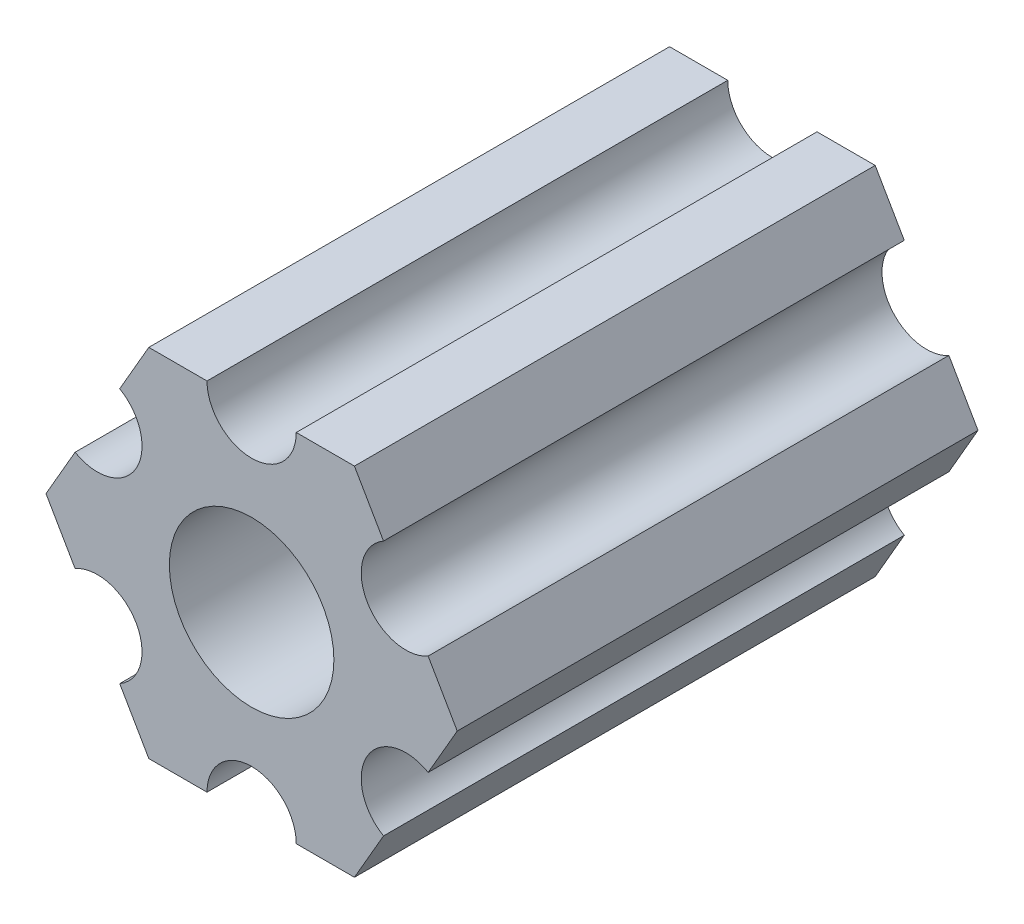
ISO-10303-21;
HEADER;
FILE_DESCRIPTION(('STEP AP214'),'2;1');
FILE_NAME('part.step','',(''),(''),'','','');
FILE_SCHEMA(('AUTOMOTIVE_DESIGN { 1 0 10303 214 1 1 1 1 }'));
ENDSEC;
DATA;
#1=APPLICATION_CONTEXT('core data for automotive mechanical design processes');
#2=APPLICATION_PROTOCOL_DEFINITION('international standard','automotive_design',2000,#1);
#3=PRODUCT_CONTEXT('',#1,'mechanical');
#4=PRODUCT('Part','Part','',(#3));
#5=PRODUCT_RELATED_PRODUCT_CATEGORY('part','',(#4));
#6=PRODUCT_DEFINITION_FORMATION('','',#4);
#7=PRODUCT_DEFINITION_CONTEXT('part definition',#1,'design');
#8=PRODUCT_DEFINITION('design','',#6,#7);
#9=PRODUCT_DEFINITION_SHAPE('','',#8);
#10=(LENGTH_UNIT() NAMED_UNIT(*) SI_UNIT(.MILLI.,.METRE.));
#11=(NAMED_UNIT(*) PLANE_ANGLE_UNIT() SI_UNIT($,.RADIAN.));
#12=(NAMED_UNIT(*) SI_UNIT($,.STERADIAN.) SOLID_ANGLE_UNIT());
#13=UNCERTAINTY_MEASURE_WITH_UNIT(LENGTH_MEASURE(1.E-05),#10,'distance_accuracy_value','');
#14=(GEOMETRIC_REPRESENTATION_CONTEXT(3) GLOBAL_UNCERTAINTY_ASSIGNED_CONTEXT((#13)) GLOBAL_UNIT_ASSIGNED_CONTEXT((#10,
#11,#12)) REPRESENTATION_CONTEXT('',''));
#15=CARTESIAN_POINT('',(0.,0.,0.));
#16=DIRECTION('',(0.,0.,1.));
#17=DIRECTION('',(1.,0.,0.));
#18=AXIS2_PLACEMENT_3D('',#15,#16,#17);
#19=CARTESIAN_POINT('',(5.4992613140312,-3.17499999999998,18.56994));
#20=DIRECTION('',(0.,0.,-1.));
#21=DIRECTION('',(-1.,0.,0.));
#22=AXIS2_PLACEMENT_3D('',#19,#20,#21);
#23=CYLINDRICAL_SURFACE('',#22,1.59130995915342);
#24=CARTESIAN_POINT('',(5.4992613140312,-3.17499999999998,0.));
#25=DIRECTION('',(0.,0.,1.));
#26=DIRECTION('',(1.,0.,0.));
#27=AXIS2_PLACEMENT_3D('',#24,#25,#26);
#28=CIRCLE('',#27,1.59130995915342);
#29=CARTESIAN_POINT('',(6.29491629360791,-1.79688515007798,0.));
#30=VERTEX_POINT('',#29);
#31=CARTESIAN_POINT('',(4.70360633445448,-4.55311484992188,0.));
#32=VERTEX_POINT('',#31);
#33=EDGE_CURVE('E186',#30,#32,#28,.T.);
#34=ORIENTED_EDGE('',*,*,#33,.F.);
#35=DIRECTION('',(0.,0.,-1.));
#36=VECTOR('',#35,1.);
#37=CARTESIAN_POINT('',(6.29491629360791,-1.79688515007798,18.56994));
#38=LINE('',#37,#36);
#39=CARTESIAN_POINT('',(6.29491629360791,-1.79688515007798,18.56994));
#40=VERTEX_POINT('',#39);
#41=EDGE_CURVE('E11',#40,#30,#38,.T.);
#42=ORIENTED_EDGE('',*,*,#41,.F.);
#43=CARTESIAN_POINT('',(5.4992613140312,-3.17499999999998,18.56994));
#44=DIRECTION('',(0.,0.,1.));
#45=DIRECTION('',(1.,0.,0.));
#46=AXIS2_PLACEMENT_3D('',#43,#44,#45);
#47=CIRCLE('',#46,1.59130995915342);
#48=CARTESIAN_POINT('',(4.70360633445448,-4.55311484992188,18.56994));
#49=VERTEX_POINT('',#48);
#50=EDGE_CURVE('E237',#40,#49,#47,.T.);
#51=ORIENTED_EDGE('',*,*,#50,.T.);
#52=DIRECTION('',(0.,0.,-1.));
#53=VECTOR('',#52,1.);
#54=CARTESIAN_POINT('',(4.70360633445448,-4.55311484992188,18.56994));
#55=LINE('',#54,#53);
#56=EDGE_CURVE('E32',#49,#32,#55,.T.);
#57=ORIENTED_EDGE('',*,*,#56,.T.);
#58=EDGE_LOOP('',(#34,#42,#51,#57));
#59=FACE_BOUND('',#58,.T.);
#60=ADVANCED_FACE('F29',(#59),#23,.F.);
#61=CARTESIAN_POINT('',(7.33234841870824,0.,18.56994));
#62=DIRECTION('',(0.86602540378444,-0.499999999999999,0.));
#63=DIRECTION('',(0.499999999999999,0.86602540378444,0.));
#64=AXIS2_PLACEMENT_3D('',#61,#62,#63);
#65=PLANE('',#64);
#66=DIRECTION('',(-0.499999999999999,-0.866025403784439,0.));
#67=VECTOR('',#66,1.);
#68=CARTESIAN_POINT('',(7.33234841870824,0.,0.));
#69=LINE('',#68,#67);
#70=CARTESIAN_POINT('',(7.33234841870824,0.,0.));
#71=VERTEX_POINT('',#70);
#72=EDGE_CURVE('E235',#71,#30,#69,.T.);
#73=ORIENTED_EDGE('',*,*,#72,.F.);
#74=DIRECTION('',(0.,0.,-1.));
#75=VECTOR('',#74,1.);
#76=CARTESIAN_POINT('',(7.33234841870824,0.,18.56994));
#77=LINE('',#76,#75);
#78=CARTESIAN_POINT('',(7.33234841870824,0.,18.56994));
#79=VERTEX_POINT('',#78);
#80=EDGE_CURVE('E38',#79,#71,#77,.T.);
#81=ORIENTED_EDGE('',*,*,#80,.F.);
#82=DIRECTION('',(-0.499999999999999,-0.866025403784439,0.));
#83=VECTOR('',#82,1.);
#84=CARTESIAN_POINT('',(7.33234841870824,0.,18.56994));
#85=LINE('',#84,#83);
#86=EDGE_CURVE('E176',#79,#40,#85,.T.);
#87=ORIENTED_EDGE('',*,*,#86,.T.);
#88=ORIENTED_EDGE('',*,*,#41,.T.);
#89=EDGE_LOOP('',(#73,#81,#87,#88));
#90=FACE_BOUND('',#89,.T.);
#91=ADVANCED_FACE('F269',(#90),#65,.T.);
#92=CARTESIAN_POINT('',(6.29491629360791,1.79688515007798,18.56994));
#93=DIRECTION('',(0.86602540378444,0.499999999999999,0.));
#94=DIRECTION('',(-0.499999999999999,0.86602540378444,0.));
#95=AXIS2_PLACEMENT_3D('',#92,#93,#94);
#96=PLANE('',#95);
#97=DIRECTION('',(0.499999999999999,-0.86602540378444,0.));
#98=VECTOR('',#97,1.);
#99=CARTESIAN_POINT('',(6.29491629360791,1.79688515007798,0.));
#100=LINE('',#99,#98);
#101=CARTESIAN_POINT('',(6.29491629360791,1.79688515007798,0.));
#102=VERTEX_POINT('',#101);
#103=EDGE_CURVE('E163',#102,#71,#100,.T.);
#104=ORIENTED_EDGE('',*,*,#103,.F.);
#105=DIRECTION('',(0.,0.,-1.));
#106=VECTOR('',#105,1.);
#107=CARTESIAN_POINT('',(6.29491629360791,1.79688515007798,18.56994));
#108=LINE('',#107,#106);
#109=CARTESIAN_POINT('',(6.29491629360791,1.79688515007798,18.56994));
#110=VERTEX_POINT('',#109);
#111=EDGE_CURVE('E158',#110,#102,#108,.T.);
#112=ORIENTED_EDGE('',*,*,#111,.F.);
#113=DIRECTION('',(0.499999999999999,-0.86602540378444,0.));
#114=VECTOR('',#113,1.);
#115=CARTESIAN_POINT('',(6.29491629360791,1.79688515007798,18.56994));
#116=LINE('',#115,#114);
#117=EDGE_CURVE('E161',#110,#79,#116,.T.);
#118=ORIENTED_EDGE('',*,*,#117,.T.);
#119=ORIENTED_EDGE('',*,*,#80,.T.);
#120=EDGE_LOOP('',(#104,#112,#118,#119));
#121=FACE_BOUND('',#120,.T.);
#122=ADVANCED_FACE('F160',(#121),#96,.T.);
#123=CARTESIAN_POINT('',(5.49926131403115,3.17500000000015,18.56994));
#124=DIRECTION('',(0.,0.,-1.));
#125=DIRECTION('',(-1.,0.,0.));
#126=AXIS2_PLACEMENT_3D('',#123,#124,#125);
#127=CYLINDRICAL_SURFACE('',#126,1.59130995915342);
#128=CARTESIAN_POINT('',(5.49926131403115,3.17500000000015,0.));
#129=DIRECTION('',(0.,0.,1.));
#130=DIRECTION('',(1.,0.,0.));
#131=AXIS2_PLACEMENT_3D('',#128,#129,#130);
#132=CIRCLE('',#131,1.59130995915342);
#133=CARTESIAN_POINT('',(4.70360633445447,4.55311484992205,0.));
#134=VERTEX_POINT('',#133);
#135=EDGE_CURVE('E232',#134,#102,#132,.T.);
#136=ORIENTED_EDGE('',*,*,#135,.F.);
#137=DIRECTION('',(0.,0.,-1.));
#138=VECTOR('',#137,1.);
#139=CARTESIAN_POINT('',(4.70360633445447,4.55311484992205,18.56994));
#140=LINE('',#139,#138);
#141=CARTESIAN_POINT('',(4.70360633445447,4.55311484992205,18.56994));
#142=VERTEX_POINT('',#141);
#143=EDGE_CURVE('E168',#142,#134,#140,.T.);
#144=ORIENTED_EDGE('',*,*,#143,.F.);
#145=CARTESIAN_POINT('',(5.49926131403115,3.17500000000015,18.56994));
#146=DIRECTION('',(0.,0.,1.));
#147=DIRECTION('',(1.,0.,0.));
#148=AXIS2_PLACEMENT_3D('',#145,#146,#147);
#149=CIRCLE('',#148,1.59130995915342);
#150=EDGE_CURVE('E174',#142,#110,#149,.T.);
#151=ORIENTED_EDGE('',*,*,#150,.T.);
#152=ORIENTED_EDGE('',*,*,#111,.T.);
#153=EDGE_LOOP('',(#136,#144,#151,#152));
#154=FACE_BOUND('',#153,.T.);
#155=ADVANCED_FACE('F178',(#154),#127,.F.);
#156=CARTESIAN_POINT('',(3.66617420935422,6.35000000000005,18.56994));
#157=DIRECTION('',(0.866025403784439,0.500000000000001,0.));
#158=DIRECTION('',(-0.500000000000001,0.866025403784439,0.));
#159=AXIS2_PLACEMENT_3D('',#156,#157,#158);
#160=PLANE('',#159);
#161=DIRECTION('',(0.5,-0.866025403784438,0.));
#162=VECTOR('',#161,1.);
#163=CARTESIAN_POINT('',(3.66617420935422,6.35000000000005,0.));
#164=LINE('',#163,#162);
#165=CARTESIAN_POINT('',(3.66617420935422,6.35000000000005,0.));
#166=VERTEX_POINT('',#165);
#167=EDGE_CURVE('E229',#166,#134,#164,.T.);
#168=ORIENTED_EDGE('',*,*,#167,.F.);
#169=DIRECTION('',(0.,0.,-1.));
#170=VECTOR('',#169,1.);
#171=CARTESIAN_POINT('',(3.66617420935422,6.35000000000005,18.56994));
#172=LINE('',#171,#170);
#173=CARTESIAN_POINT('',(3.66617420935422,6.35000000000005,18.56994));
#174=VERTEX_POINT('',#173);
#175=EDGE_CURVE('E241',#174,#166,#172,.T.);
#176=ORIENTED_EDGE('',*,*,#175,.F.);
#177=DIRECTION('',(0.5,-0.866025403784438,0.));
#178=VECTOR('',#177,1.);
#179=CARTESIAN_POINT('',(3.66617420935422,6.35000000000005,18.56994));
#180=LINE('',#179,#178);
#181=EDGE_CURVE('E179',#174,#142,#180,.T.);
#182=ORIENTED_EDGE('',*,*,#181,.T.);
#183=ORIENTED_EDGE('',*,*,#143,.T.);
#184=EDGE_LOOP('',(#168,#176,#182,#183));
#185=FACE_BOUND('',#184,.T.);
#186=ADVANCED_FACE('F282',(#185),#160,.T.);
#187=CARTESIAN_POINT('',(1.59130995915353,6.35000000000005,18.56994));
#188=DIRECTION('',(0.,1.,0.));
#189=DIRECTION('',(0.,0.,1.));
#190=AXIS2_PLACEMENT_3D('',#187,#188,#189);
#191=PLANE('',#190);
#192=DIRECTION('',(1.,0.,0.));
#193=VECTOR('',#192,1.);
#194=CARTESIAN_POINT('',(1.59130995915353,6.35000000000005,0.));
#195=LINE('',#194,#193);
#196=CARTESIAN_POINT('',(1.59130995915353,6.35000000000005,0.));
#197=VERTEX_POINT('',#196);
#198=EDGE_CURVE('E226',#197,#166,#195,.T.);
#199=ORIENTED_EDGE('',*,*,#198,.F.);
#200=DIRECTION('',(0.,0.,-1.));
#201=VECTOR('',#200,1.);
#202=CARTESIAN_POINT('',(1.59130995915353,6.35000000000005,18.56994));
#203=LINE('',#202,#201);
#204=CARTESIAN_POINT('',(1.59130995915353,6.35000000000005,18.56994));
#205=VERTEX_POINT('',#204);
#206=EDGE_CURVE('E243',#205,#197,#203,.T.);
#207=ORIENTED_EDGE('',*,*,#206,.F.);
#208=DIRECTION('',(1.,0.,0.));
#209=VECTOR('',#208,1.);
#210=CARTESIAN_POINT('',(1.59130995915353,6.35000000000005,18.56994));
#211=LINE('',#210,#209);
#212=EDGE_CURVE('E181',#205,#174,#211,.T.);
#213=ORIENTED_EDGE('',*,*,#212,.T.);
#214=ORIENTED_EDGE('',*,*,#175,.T.);
#215=EDGE_LOOP('',(#199,#207,#213,#214));
#216=FACE_BOUND('',#215,.T.);
#217=ADVANCED_FACE('F285',(#216),#191,.T.);
#218=CARTESIAN_POINT('',(0.,6.35000000000011,18.56994));
#219=DIRECTION('',(0.,0.,-1.));
#220=DIRECTION('',(-1.,0.,0.));
#221=AXIS2_PLACEMENT_3D('',#218,#219,#220);
#222=CYLINDRICAL_SURFACE('',#221,1.59130995915342);
#223=CARTESIAN_POINT('',(0.,6.35000000000011,0.));
#224=DIRECTION('',(0.,0.,1.));
#225=DIRECTION('',(1.,0.,0.));
#226=AXIS2_PLACEMENT_3D('',#223,#224,#225);
#227=CIRCLE('',#226,1.59130995915342);
#228=CARTESIAN_POINT('',(-1.59130995915337,6.35000000000002,0.));
#229=VERTEX_POINT('',#228);
#230=EDGE_CURVE('E223',#229,#197,#227,.T.);
#231=ORIENTED_EDGE('',*,*,#230,.F.);
#232=DIRECTION('',(0.,0.,-1.));
#233=VECTOR('',#232,1.);
#234=CARTESIAN_POINT('',(-1.59130995915337,6.35000000000002,18.56994));
#235=LINE('',#234,#233);
#236=CARTESIAN_POINT('',(-1.59130995915337,6.35000000000002,18.56994));
#237=VERTEX_POINT('',#236);
#238=EDGE_CURVE('E245',#237,#229,#235,.T.);
#239=ORIENTED_EDGE('',*,*,#238,.F.);
#240=CARTESIAN_POINT('',(0.,6.35000000000011,18.56994));
#241=DIRECTION('',(0.,0.,1.));
#242=DIRECTION('',(1.,0.,0.));
#243=AXIS2_PLACEMENT_3D('',#240,#241,#242);
#244=CIRCLE('',#243,1.59130995915342);
#245=EDGE_CURVE('E390',#237,#205,#244,.T.);
#246=ORIENTED_EDGE('',*,*,#245,.T.);
#247=ORIENTED_EDGE('',*,*,#206,.T.);
#248=EDGE_LOOP('',(#231,#239,#246,#247));
#249=FACE_BOUND('',#248,.T.);
#250=ADVANCED_FACE('F289',(#249),#222,.F.);
#251=CARTESIAN_POINT('',(-3.66617420935408,6.35000000000011,18.56994));
#252=DIRECTION('',(0.,1.,0.));
#253=DIRECTION('',(0.,0.,1.));
#254=AXIS2_PLACEMENT_3D('',#251,#252,#253);
#255=PLANE('',#254);
#256=DIRECTION('',(1.,0.,0.));
#257=VECTOR('',#256,1.);
#258=CARTESIAN_POINT('',(-3.66617420935408,6.35000000000011,0.));
#259=LINE('',#258,#257);
#260=CARTESIAN_POINT('',(-3.66617420935408,6.35000000000011,0.));
#261=VERTEX_POINT('',#260);
#262=EDGE_CURVE('E220',#261,#229,#259,.T.);
#263=ORIENTED_EDGE('',*,*,#262,.F.);
#264=DIRECTION('',(0.,0.,-1.));
#265=VECTOR('',#264,1.);
#266=CARTESIAN_POINT('',(-3.66617420935408,6.35000000000011,18.56994));
#267=LINE('',#266,#265);
#268=CARTESIAN_POINT('',(-3.66617420935408,6.35000000000011,18.56994));
#269=VERTEX_POINT('',#268);
#270=EDGE_CURVE('E247',#269,#261,#267,.T.);
#271=ORIENTED_EDGE('',*,*,#270,.F.);
#272=DIRECTION('',(1.,0.,0.));
#273=VECTOR('',#272,1.);
#274=CARTESIAN_POINT('',(-3.66617420935408,6.35000000000011,18.56994));
#275=LINE('',#274,#273);
#276=EDGE_CURVE('E387',#269,#237,#275,.T.);
#277=ORIENTED_EDGE('',*,*,#276,.T.);
#278=ORIENTED_EDGE('',*,*,#238,.T.);
#279=EDGE_LOOP('',(#263,#271,#277,#278));
#280=FACE_BOUND('',#279,.T.);
#281=ADVANCED_FACE('F293',(#280),#255,.T.);
#282=CARTESIAN_POINT('',(-4.70360633445442,4.55311484992213,18.56994));
#283=DIRECTION('',(-0.866025403784439,0.5,0.));
#284=DIRECTION('',(-0.5,-0.866025403784439,0.));
#285=AXIS2_PLACEMENT_3D('',#282,#283,#284);
#286=PLANE('',#285);
#287=DIRECTION('',(0.5,0.866025403784439,0.));
#288=VECTOR('',#287,1.);
#289=CARTESIAN_POINT('',(-4.70360633445442,4.55311484992213,0.));
#290=LINE('',#289,#288);
#291=CARTESIAN_POINT('',(-4.70360633445442,4.55311484992213,0.));
#292=VERTEX_POINT('',#291);
#293=EDGE_CURVE('E217',#292,#261,#290,.T.);
#294=ORIENTED_EDGE('',*,*,#293,.F.);
#295=DIRECTION('',(0.,0.,-1.));
#296=VECTOR('',#295,1.);
#297=CARTESIAN_POINT('',(-4.70360633445442,4.55311484992213,18.56994));
#298=LINE('',#297,#296);
#299=CARTESIAN_POINT('',(-4.70360633445442,4.55311484992213,18.56994));
#300=VERTEX_POINT('',#299);
#301=EDGE_CURVE('E249',#300,#292,#298,.T.);
#302=ORIENTED_EDGE('',*,*,#301,.F.);
#303=DIRECTION('',(0.5,0.866025403784439,0.));
#304=VECTOR('',#303,1.);
#305=CARTESIAN_POINT('',(-4.70360633445442,4.55311484992213,18.56994));
#306=LINE('',#305,#304);
#307=EDGE_CURVE('E384',#300,#269,#306,.T.);
#308=ORIENTED_EDGE('',*,*,#307,.T.);
#309=ORIENTED_EDGE('',*,*,#270,.T.);
#310=EDGE_LOOP('',(#294,#302,#308,#309));
#311=FACE_BOUND('',#310,.T.);
#312=ADVANCED_FACE('F297',(#311),#286,.T.);
#313=CARTESIAN_POINT('',(-5.49926131403112,3.17500000000009,18.56994));
#314=DIRECTION('',(0.,0.,-1.));
#315=DIRECTION('',(-1.,0.,0.));
#316=AXIS2_PLACEMENT_3D('',#313,#314,#315);
#317=CYLINDRICAL_SURFACE('',#316,1.59130995915342);
#318=CARTESIAN_POINT('',(-5.49926131403112,3.17500000000009,0.));
#319=DIRECTION('',(0.,0.,1.));
#320=DIRECTION('',(1.,0.,0.));
#321=AXIS2_PLACEMENT_3D('',#318,#319,#320);
#322=CIRCLE('',#321,1.59130995915342);
#323=CARTESIAN_POINT('',(-6.29491629360782,1.79688515007809,0.));
#324=VERTEX_POINT('',#323);
#325=EDGE_CURVE('E214',#324,#292,#322,.T.);
#326=ORIENTED_EDGE('',*,*,#325,.F.);
#327=DIRECTION('',(0.,0.,-1.));
#328=VECTOR('',#327,1.);
#329=CARTESIAN_POINT('',(-6.29491629360782,1.79688515007809,18.56994));
#330=LINE('',#329,#328);
#331=CARTESIAN_POINT('',(-6.29491629360782,1.79688515007809,18.56994));
#332=VERTEX_POINT('',#331);
#333=EDGE_CURVE('E251',#332,#324,#330,.T.);
#334=ORIENTED_EDGE('',*,*,#333,.F.);
#335=CARTESIAN_POINT('',(-5.49926131403112,3.17500000000009,18.56994));
#336=DIRECTION('',(0.,0.,1.));
#337=DIRECTION('',(1.,0.,0.));
#338=AXIS2_PLACEMENT_3D('',#335,#336,#337);
#339=CIRCLE('',#338,1.59130995915342);
#340=EDGE_CURVE('E381',#332,#300,#339,.T.);
#341=ORIENTED_EDGE('',*,*,#340,.T.);
#342=ORIENTED_EDGE('',*,*,#301,.T.);
#343=EDGE_LOOP('',(#326,#334,#341,#342));
#344=FACE_BOUND('',#343,.T.);
#345=ADVANCED_FACE('F301',(#344),#317,.F.);
#346=CARTESIAN_POINT('',(-7.33234841870815,0.,18.56994));
#347=DIRECTION('',(-0.866025403784438,0.5,0.));
#348=DIRECTION('',(-0.5,-0.866025403784438,0.));
#349=AXIS2_PLACEMENT_3D('',#346,#347,#348);
#350=PLANE('',#349);
#351=DIRECTION('',(0.5,0.866025403784438,0.));
#352=VECTOR('',#351,1.);
#353=CARTESIAN_POINT('',(-7.33234841870815,0.,0.));
#354=LINE('',#353,#352);
#355=CARTESIAN_POINT('',(-7.33234841870815,0.,0.));
#356=VERTEX_POINT('',#355);
#357=EDGE_CURVE('E211',#356,#324,#354,.T.);
#358=ORIENTED_EDGE('',*,*,#357,.F.);
#359=DIRECTION('',(0.,0.,-1.));
#360=VECTOR('',#359,1.);
#361=CARTESIAN_POINT('',(-7.33234841870815,0.,18.56994));
#362=LINE('',#361,#360);
#363=CARTESIAN_POINT('',(-7.33234841870815,0.,18.56994));
#364=VERTEX_POINT('',#363);
#365=EDGE_CURVE('E253',#364,#356,#362,.T.);
#366=ORIENTED_EDGE('',*,*,#365,.F.);
#367=DIRECTION('',(0.5,0.866025403784438,0.));
#368=VECTOR('',#367,1.);
#369=CARTESIAN_POINT('',(-7.33234841870815,0.,18.56994));
#370=LINE('',#369,#368);
#371=EDGE_CURVE('E378',#364,#332,#370,.T.);
#372=ORIENTED_EDGE('',*,*,#371,.T.);
#373=ORIENTED_EDGE('',*,*,#333,.T.);
#374=EDGE_LOOP('',(#358,#366,#372,#373));
#375=FACE_BOUND('',#374,.T.);
#376=ADVANCED_FACE('F305',(#375),#350,.T.);
#377=CARTESIAN_POINT('',(-6.29491629360792,-1.79688515007792,18.56994));
#378=DIRECTION('',(-0.866025403784439,-0.5,0.));
#379=DIRECTION('',(0.5,-0.866025403784439,0.));
#380=AXIS2_PLACEMENT_3D('',#377,#378,#379);
#381=PLANE('',#380);
#382=DIRECTION('',(-0.5,0.866025403784439,0.));
#383=VECTOR('',#382,1.);
#384=CARTESIAN_POINT('',(-6.29491629360792,-1.79688515007792,0.));
#385=LINE('',#384,#383);
#386=CARTESIAN_POINT('',(-6.29491629360792,-1.79688515007792,0.));
#387=VERTEX_POINT('',#386);
#388=EDGE_CURVE('E208',#387,#356,#385,.T.);
#389=ORIENTED_EDGE('',*,*,#388,.F.);
#390=DIRECTION('',(0.,0.,-1.));
#391=VECTOR('',#390,1.);
#392=CARTESIAN_POINT('',(-6.29491629360792,-1.79688515007792,18.56994));
#393=LINE('',#392,#391);
#394=CARTESIAN_POINT('',(-6.29491629360792,-1.79688515007792,18.56994));
#395=VERTEX_POINT('',#394);
#396=EDGE_CURVE('E255',#395,#387,#393,.T.);
#397=ORIENTED_EDGE('',*,*,#396,.F.);
#398=DIRECTION('',(-0.5,0.866025403784439,0.));
#399=VECTOR('',#398,1.);
#400=CARTESIAN_POINT('',(-6.29491629360792,-1.79688515007792,18.56994));
#401=LINE('',#400,#399);
#402=EDGE_CURVE('E375',#395,#364,#401,.T.);
#403=ORIENTED_EDGE('',*,*,#402,.T.);
#404=ORIENTED_EDGE('',*,*,#365,.T.);
#405=EDGE_LOOP('',(#389,#397,#403,#404));
#406=FACE_BOUND('',#405,.T.);
#407=ADVANCED_FACE('F309',(#406),#381,.T.);
#408=CARTESIAN_POINT('',(-5.49926131403123,-3.17499999999993,18.56994));
#409=DIRECTION('',(0.,0.,-1.));
#410=DIRECTION('',(-1.,0.,0.));
#411=AXIS2_PLACEMENT_3D('',#408,#409,#410);
#412=CYLINDRICAL_SURFACE('',#411,1.59130995915342);
#413=CARTESIAN_POINT('',(-5.49926131403123,-3.17499999999993,0.));
#414=DIRECTION('',(0.,0.,1.));
#415=DIRECTION('',(1.,0.,0.));
#416=AXIS2_PLACEMENT_3D('',#413,#414,#415);
#417=CIRCLE('',#416,1.59130995915342);
#418=CARTESIAN_POINT('',(-4.70360633445447,-4.55311484992205,0.));
#419=VERTEX_POINT('',#418);
#420=EDGE_CURVE('E205',#419,#387,#417,.T.);
#421=ORIENTED_EDGE('',*,*,#420,.F.);
#422=DIRECTION('',(0.,0.,-1.));
#423=VECTOR('',#422,1.);
#424=CARTESIAN_POINT('',(-4.70360633445447,-4.55311484992205,18.56994));
#425=LINE('',#424,#423);
#426=CARTESIAN_POINT('',(-4.70360633445447,-4.55311484992205,18.56994));
#427=VERTEX_POINT('',#426);
#428=EDGE_CURVE('E257',#427,#419,#425,.T.);
#429=ORIENTED_EDGE('',*,*,#428,.F.);
#430=CARTESIAN_POINT('',(-5.49926131403123,-3.17499999999993,18.56994));
#431=DIRECTION('',(0.,0.,1.));
#432=DIRECTION('',(1.,0.,0.));
#433=AXIS2_PLACEMENT_3D('',#430,#431,#432);
#434=CIRCLE('',#433,1.59130995915342);
#435=EDGE_CURVE('E372',#427,#395,#434,.T.);
#436=ORIENTED_EDGE('',*,*,#435,.T.);
#437=ORIENTED_EDGE('',*,*,#396,.T.);
#438=EDGE_LOOP('',(#421,#429,#436,#437));
#439=FACE_BOUND('',#438,.T.);
#440=ADVANCED_FACE('F313',(#439),#412,.F.);
#441=CARTESIAN_POINT('',(-3.6661742093541,-6.34999999999997,18.56994));
#442=DIRECTION('',(-0.866025403784439,-0.5,0.));
#443=DIRECTION('',(0.5,-0.866025403784439,0.));
#444=AXIS2_PLACEMENT_3D('',#441,#442,#443);
#445=PLANE('',#444);
#446=DIRECTION('',(-0.5,0.866025403784439,0.));
#447=VECTOR('',#446,1.);
#448=CARTESIAN_POINT('',(-3.6661742093541,-6.34999999999997,0.));
#449=LINE('',#448,#447);
#450=CARTESIAN_POINT('',(-3.6661742093541,-6.34999999999997,0.));
#451=VERTEX_POINT('',#450);
#452=EDGE_CURVE('E202',#451,#419,#449,.T.);
#453=ORIENTED_EDGE('',*,*,#452,.F.);
#454=DIRECTION('',(0.,0.,-1.));
#455=VECTOR('',#454,1.);
#456=CARTESIAN_POINT('',(-3.6661742093541,-6.34999999999997,18.56994));
#457=LINE('',#456,#455);
#458=CARTESIAN_POINT('',(-3.6661742093541,-6.34999999999997,18.56994));
#459=VERTEX_POINT('',#458);
#460=EDGE_CURVE('E259',#459,#451,#457,.T.);
#461=ORIENTED_EDGE('',*,*,#460,.F.);
#462=DIRECTION('',(-0.5,0.866025403784439,0.));
#463=VECTOR('',#462,1.);
#464=CARTESIAN_POINT('',(-3.6661742093541,-6.34999999999997,18.56994));
#465=LINE('',#464,#463);
#466=EDGE_CURVE('E369',#459,#427,#465,.T.);
#467=ORIENTED_EDGE('',*,*,#466,.T.);
#468=ORIENTED_EDGE('',*,*,#428,.T.);
#469=EDGE_LOOP('',(#453,#461,#467,#468));
#470=FACE_BOUND('',#469,.T.);
#471=ADVANCED_FACE('F317',(#470),#445,.T.);
#472=CARTESIAN_POINT('',(-1.59130995915342,-6.35000000000002,18.56994));
#473=DIRECTION('',(0.,-1.,0.));
#474=DIRECTION('',(0.,0.,-1.));
#475=AXIS2_PLACEMENT_3D('',#472,#473,#474);
#476=PLANE('',#475);
#477=DIRECTION('',(-1.,0.,0.));
#478=VECTOR('',#477,1.);
#479=CARTESIAN_POINT('',(-1.59130995915342,-6.35000000000002,0.));
#480=LINE('',#479,#478);
#481=CARTESIAN_POINT('',(-1.59130995915342,-6.35000000000002,0.));
#482=VERTEX_POINT('',#481);
#483=EDGE_CURVE('E199',#482,#451,#480,.T.);
#484=ORIENTED_EDGE('',*,*,#483,.F.);
#485=DIRECTION('',(0.,0.,-1.));
#486=VECTOR('',#485,1.);
#487=CARTESIAN_POINT('',(-1.59130995915342,-6.35000000000002,18.56994));
#488=LINE('',#487,#486);
#489=CARTESIAN_POINT('',(-1.59130995915342,-6.35000000000002,18.56994));
#490=VERTEX_POINT('',#489);
#491=EDGE_CURVE('E261',#490,#482,#488,.T.);
#492=ORIENTED_EDGE('',*,*,#491,.F.);
#493=DIRECTION('',(-1.,0.,0.));
#494=VECTOR('',#493,1.);
#495=CARTESIAN_POINT('',(-1.59130995915342,-6.35000000000002,18.56994));
#496=LINE('',#495,#494);
#497=EDGE_CURVE('E366',#490,#459,#496,.T.);
#498=ORIENTED_EDGE('',*,*,#497,.T.);
#499=ORIENTED_EDGE('',*,*,#460,.T.);
#500=EDGE_LOOP('',(#484,#492,#498,#499));
#501=FACE_BOUND('',#500,.T.);
#502=ADVANCED_FACE('F321',(#501),#476,.T.);
#503=CARTESIAN_POINT('',(0.,-6.34999999999997,18.56994));
#504=DIRECTION('',(0.,0.,-1.));
#505=DIRECTION('',(-1.,0.,0.));
#506=AXIS2_PLACEMENT_3D('',#503,#504,#505);
#507=CYLINDRICAL_SURFACE('',#506,1.59130995915342);
#508=CARTESIAN_POINT('',(0.,-6.34999999999997,0.));
#509=DIRECTION('',(0.,0.,1.));
#510=DIRECTION('',(1.,0.,0.));
#511=AXIS2_PLACEMENT_3D('',#508,#509,#510);
#512=CIRCLE('',#511,1.59130995915342);
#513=CARTESIAN_POINT('',(1.59130995915344,-6.34999999999997,0.));
#514=VERTEX_POINT('',#513);
#515=EDGE_CURVE('E196',#514,#482,#512,.T.);
#516=ORIENTED_EDGE('',*,*,#515,.F.);
#517=DIRECTION('',(0.,0.,-1.));
#518=VECTOR('',#517,1.);
#519=CARTESIAN_POINT('',(1.59130995915344,-6.34999999999997,18.56994));
#520=LINE('',#519,#518);
#521=CARTESIAN_POINT('',(1.59130995915344,-6.34999999999997,18.56994));
#522=VERTEX_POINT('',#521);
#523=EDGE_CURVE('E263',#522,#514,#520,.T.);
#524=ORIENTED_EDGE('',*,*,#523,.F.);
#525=CARTESIAN_POINT('',(0.,-6.34999999999997,18.56994));
#526=DIRECTION('',(0.,0.,1.));
#527=DIRECTION('',(1.,0.,0.));
#528=AXIS2_PLACEMENT_3D('',#525,#526,#527);
#529=CIRCLE('',#528,1.59130995915342);
#530=EDGE_CURVE('E363',#522,#490,#529,.T.);
#531=ORIENTED_EDGE('',*,*,#530,.T.);
#532=ORIENTED_EDGE('',*,*,#491,.T.);
#533=EDGE_LOOP('',(#516,#524,#531,#532));
#534=FACE_BOUND('',#533,.T.);
#535=ADVANCED_FACE('F325',(#534),#507,.F.);
#536=CARTESIAN_POINT('',(3.66617420935417,-6.35000000000002,18.56994));
#537=DIRECTION('',(0.,-1.,0.));
#538=DIRECTION('',(0.,0.,-1.));
#539=AXIS2_PLACEMENT_3D('',#536,#537,#538);
#540=PLANE('',#539);
#541=DIRECTION('',(-1.,0.,0.));
#542=VECTOR('',#541,1.);
#543=CARTESIAN_POINT('',(3.66617420935417,-6.35000000000002,0.));
#544=LINE('',#543,#542);
#545=CARTESIAN_POINT('',(3.66617420935417,-6.35000000000002,0.));
#546=VERTEX_POINT('',#545);
#547=EDGE_CURVE('E193',#546,#514,#544,.T.);
#548=ORIENTED_EDGE('',*,*,#547,.F.);
#549=DIRECTION('',(0.,0.,-1.));
#550=VECTOR('',#549,1.);
#551=CARTESIAN_POINT('',(3.66617420935417,-6.35000000000002,18.56994));
#552=LINE('',#551,#550);
#553=CARTESIAN_POINT('',(3.66617420935417,-6.35000000000002,18.56994));
#554=VERTEX_POINT('',#553);
#555=EDGE_CURVE('E264',#554,#546,#552,.T.);
#556=ORIENTED_EDGE('',*,*,#555,.F.);
#557=DIRECTION('',(-1.,0.,0.));
#558=VECTOR('',#557,1.);
#559=CARTESIAN_POINT('',(3.66617420935417,-6.35000000000002,18.56994));
#560=LINE('',#559,#558);
#561=EDGE_CURVE('E360',#554,#522,#560,.T.);
#562=ORIENTED_EDGE('',*,*,#561,.T.);
#563=ORIENTED_EDGE('',*,*,#523,.T.);
#564=EDGE_LOOP('',(#548,#556,#562,#563));
#565=FACE_BOUND('',#564,.T.);
#566=ADVANCED_FACE('F329',(#565),#540,.T.);
#567=CARTESIAN_POINT('',(4.70360633445448,-4.55311484992188,18.56994));
#568=DIRECTION('',(0.866025403784439,-0.500000000000001,0.));
#569=DIRECTION('',(0.500000000000001,0.866025403784439,0.));
#570=AXIS2_PLACEMENT_3D('',#567,#568,#569);
#571=PLANE('',#570);
#572=DIRECTION('',(-0.500000000000001,-0.866025403784439,0.));
#573=VECTOR('',#572,1.);
#574=CARTESIAN_POINT('',(4.70360633445448,-4.55311484992188,0.));
#575=LINE('',#574,#573);
#576=EDGE_CURVE('E189',#32,#546,#575,.T.);
#577=ORIENTED_EDGE('',*,*,#576,.F.);
#578=ORIENTED_EDGE('',*,*,#56,.F.);
#579=DIRECTION('',(-0.500000000000001,-0.866025403784439,0.));
#580=VECTOR('',#579,1.);
#581=CARTESIAN_POINT('',(4.70360633445448,-4.55311484992188,18.56994));
#582=LINE('',#581,#580);
#583=EDGE_CURVE('E358',#49,#554,#582,.T.);
#584=ORIENTED_EDGE('',*,*,#583,.T.);
#585=ORIENTED_EDGE('',*,*,#555,.T.);
#586=EDGE_LOOP('',(#577,#578,#584,#585));
#587=FACE_BOUND('',#586,.T.);
#588=ADVANCED_FACE('F266',(#587),#571,.T.);
#589=CARTESIAN_POINT('',(5.4992613140312,-3.17499999999998,18.56994));
#590=DIRECTION('',(0.,0.,1.));
#591=DIRECTION('',(1.,0.,0.));
#592=AXIS2_PLACEMENT_3D('',#589,#590,#591);
#593=PLANE('',#592);
#594=CARTESIAN_POINT('',(0.,0.,18.56994));
#595=DIRECTION('',(0.,0.,-1.));
#596=DIRECTION('',(1.,0.,0.));
#597=AXIS2_PLACEMENT_3D('',#594,#595,#596);
#598=CIRCLE('',#597,2.9337);
#599=CARTESIAN_POINT('',(2.9337,0.,18.56994));
#600=VERTEX_POINT('',#599);
#601=EDGE_CURVE('E190',#600,#600,#598,.T.);
#602=ORIENTED_EDGE('',*,*,#601,.T.);
#603=EDGE_LOOP('',(#602));
#604=FACE_BOUND('',#603,.T.);
#605=ORIENTED_EDGE('',*,*,#50,.F.);
#606=ORIENTED_EDGE('',*,*,#86,.F.);
#607=ORIENTED_EDGE('',*,*,#117,.F.);
#608=ORIENTED_EDGE('',*,*,#150,.F.);
#609=ORIENTED_EDGE('',*,*,#181,.F.);
#610=ORIENTED_EDGE('',*,*,#212,.F.);
#611=ORIENTED_EDGE('',*,*,#245,.F.);
#612=ORIENTED_EDGE('',*,*,#276,.F.);
#613=ORIENTED_EDGE('',*,*,#307,.F.);
#614=ORIENTED_EDGE('',*,*,#340,.F.);
#615=ORIENTED_EDGE('',*,*,#371,.F.);
#616=ORIENTED_EDGE('',*,*,#402,.F.);
#617=ORIENTED_EDGE('',*,*,#435,.F.);
#618=ORIENTED_EDGE('',*,*,#466,.F.);
#619=ORIENTED_EDGE('',*,*,#497,.F.);
#620=ORIENTED_EDGE('',*,*,#530,.F.);
#621=ORIENTED_EDGE('',*,*,#561,.F.);
#622=ORIENTED_EDGE('',*,*,#583,.F.);
#623=EDGE_LOOP('',(#605,#606,#607,#608,#609,#610,#611,#612,#613,#614,#615,#616,#617,#618,#619,
#620,#621,#622));
#624=FACE_BOUND('',#623,.T.);
#625=ADVANCED_FACE('F172',(#604,#624),#593,.T.);
#626=CARTESIAN_POINT('',(5.4992613140312,-3.17499999999998,0.));
#627=DIRECTION('',(0.,0.,1.));
#628=DIRECTION('',(1.,0.,0.));
#629=AXIS2_PLACEMENT_3D('',#626,#627,#628);
#630=PLANE('',#629);
#631=CARTESIAN_POINT('',(0.,0.,0.));
#632=DIRECTION('',(0.,0.,-1.));
#633=DIRECTION('',(1.,0.,0.));
#634=AXIS2_PLACEMENT_3D('',#631,#632,#633);
#635=CIRCLE('',#634,2.9337);
#636=CARTESIAN_POINT('',(2.9337,0.,0.));
#637=VERTEX_POINT('',#636);
#638=EDGE_CURVE('E353',#637,#637,#635,.T.);
#639=ORIENTED_EDGE('',*,*,#638,.F.);
#640=EDGE_LOOP('',(#639));
#641=FACE_BOUND('',#640,.T.);
#642=ORIENTED_EDGE('',*,*,#33,.T.);
#643=ORIENTED_EDGE('',*,*,#576,.T.);
#644=ORIENTED_EDGE('',*,*,#547,.T.);
#645=ORIENTED_EDGE('',*,*,#515,.T.);
#646=ORIENTED_EDGE('',*,*,#483,.T.);
#647=ORIENTED_EDGE('',*,*,#452,.T.);
#648=ORIENTED_EDGE('',*,*,#420,.T.);
#649=ORIENTED_EDGE('',*,*,#388,.T.);
#650=ORIENTED_EDGE('',*,*,#357,.T.);
#651=ORIENTED_EDGE('',*,*,#325,.T.);
#652=ORIENTED_EDGE('',*,*,#293,.T.);
#653=ORIENTED_EDGE('',*,*,#262,.T.);
#654=ORIENTED_EDGE('',*,*,#230,.T.);
#655=ORIENTED_EDGE('',*,*,#198,.T.);
#656=ORIENTED_EDGE('',*,*,#167,.T.);
#657=ORIENTED_EDGE('',*,*,#135,.T.);
#658=ORIENTED_EDGE('',*,*,#103,.T.);
#659=ORIENTED_EDGE('',*,*,#72,.T.);
#660=EDGE_LOOP('',(#642,#643,#644,#645,#646,#647,#648,#649,#650,#651,#652,#653,#654,#655,#656,
#657,#658,#659));
#661=FACE_BOUND('',#660,.T.);
#662=ADVANCED_FACE('F268',(#641,#661),#630,.F.);
#663=CARTESIAN_POINT('',(0.,0.,18.56994));
#664=DIRECTION('',(0.,0.,-1.));
#665=DIRECTION('',(-1.,0.,0.));
#666=AXIS2_PLACEMENT_3D('',#663,#664,#665);
#667=CYLINDRICAL_SURFACE('',#666,2.9337);
#668=ORIENTED_EDGE('',*,*,#601,.F.);
#669=EDGE_LOOP('',(#668));
#670=FACE_BOUND('',#669,.T.);
#671=ORIENTED_EDGE('',*,*,#638,.T.);
#672=EDGE_LOOP('',(#671));
#673=FACE_BOUND('',#672,.T.);
#674=ADVANCED_FACE('F341',(#670,#673),#667,.F.);
#675=CLOSED_SHELL('',(#60,#91,#122,#155,#186,#217,#250,#281,#312,#345,#376,#407,#440,#471,#502,
#535,#566,#588,#625,#662,#674));
#676=MANIFOLD_SOLID_BREP('B2',#675);
#677=ADVANCED_BREP_SHAPE_REPRESENTATION('',(#18,#676),#14);
#678=SHAPE_DEFINITION_REPRESENTATION(#9,#677);
ENDSEC;
END-ISO-10303-21;
